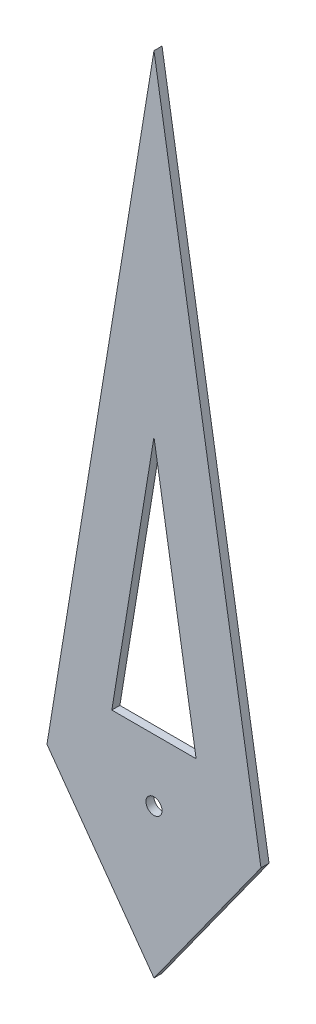
ISO-10303-21;
HEADER;
FILE_DESCRIPTION(('STEP AP214'),'2;1');
FILE_NAME('part.step','',(''),(''),'','','');
FILE_SCHEMA(('AUTOMOTIVE_DESIGN { 1 0 10303 214 1 1 1 1 }'));
ENDSEC;
DATA;
#1=APPLICATION_CONTEXT('core data for automotive mechanical design processes');
#2=APPLICATION_PROTOCOL_DEFINITION('international standard','automotive_design',2000,#1);
#3=PRODUCT_CONTEXT('',#1,'mechanical');
#4=PRODUCT('Part','Part','',(#3));
#5=PRODUCT_RELATED_PRODUCT_CATEGORY('part','',(#4));
#6=PRODUCT_DEFINITION_FORMATION('','',#4);
#7=PRODUCT_DEFINITION_CONTEXT('part definition',#1,'design');
#8=PRODUCT_DEFINITION('design','',#6,#7);
#9=PRODUCT_DEFINITION_SHAPE('','',#8);
#10=(LENGTH_UNIT() NAMED_UNIT(*) SI_UNIT(.MILLI.,.METRE.));
#11=(NAMED_UNIT(*) PLANE_ANGLE_UNIT() SI_UNIT($,.RADIAN.));
#12=(NAMED_UNIT(*) SI_UNIT($,.STERADIAN.) SOLID_ANGLE_UNIT());
#13=UNCERTAINTY_MEASURE_WITH_UNIT(LENGTH_MEASURE(1.E-05),#10,'distance_accuracy_value','');
#14=(GEOMETRIC_REPRESENTATION_CONTEXT(3) GLOBAL_UNCERTAINTY_ASSIGNED_CONTEXT((#13)) GLOBAL_UNIT_ASSIGNED_CONTEXT((#10,
#11,#12)) REPRESENTATION_CONTEXT('',''));
#15=CARTESIAN_POINT('',(0.,0.,0.));
#16=DIRECTION('',(0.,0.,1.));
#17=DIRECTION('',(1.,0.,0.));
#18=AXIS2_PLACEMENT_3D('',#15,#16,#17);
#19=CARTESIAN_POINT('',(-0.664568147771195,-0.385728496269406,0.05));
#20=DIRECTION('',(0.,0.,1.));
#21=DIRECTION('',(1.,0.,0.));
#22=AXIS2_PLACEMENT_3D('',#19,#20,#21);
#23=PLANE('',#22);
#24=CARTESIAN_POINT('',(0.,-0.385728496269408,0.05));
#25=DIRECTION('',(0.,0.,1.));
#26=DIRECTION('',(1.,0.,0.));
#27=AXIS2_PLACEMENT_3D('',#24,#25,#26);
#28=CIRCLE('',#27,0.05);
#29=CARTESIAN_POINT('',(0.05,-0.385728496269408,0.05));
#30=VERTEX_POINT('',#29);
#31=EDGE_CURVE('E206',#30,#30,#28,.T.);
#32=ORIENTED_EDGE('',*,*,#31,.F.);
#33=EDGE_LOOP('',(#32));
#34=FACE_BOUND('',#33,.T.);
#35=DIRECTION('',(-0.161416191453951,-0.986886423625587,0.));
#36=VECTOR('',#35,1.);
#37=CARTESIAN_POINT('',(0.,3.67739105017645,0.05));
#38=LINE('',#37,#36);
#39=CARTESIAN_POINT('',(0.,3.67739105017645,0.05));
#40=VERTEX_POINT('',#39);
#41=CARTESIAN_POINT('',(-0.664568147771194,-0.385728496269408,0.05));
#42=VERTEX_POINT('',#41);
#43=EDGE_CURVE('E121',#40,#42,#38,.T.);
#44=ORIENTED_EDGE('',*,*,#43,.T.);
#45=DIRECTION('',(0.58369559883618,-0.811972565977,0.));
#46=VECTOR('',#45,1.);
#47=CARTESIAN_POINT('',(-0.664568147771194,-0.385728496269408,0.05));
#48=LINE('',#47,#46);
#49=CARTESIAN_POINT('',(0.,-1.31020198088755,0.05));
#50=VERTEX_POINT('',#49);
#51=EDGE_CURVE('E124',#42,#50,#48,.T.);
#52=ORIENTED_EDGE('',*,*,#51,.T.);
#53=DIRECTION('',(0.58369559883618,0.811972565977,0.));
#54=VECTOR('',#53,1.);
#55=CARTESIAN_POINT('',(0.664568147771193,-0.385728496269408,0.05));
#56=LINE('',#55,#54);
#57=CARTESIAN_POINT('',(0.664568147771193,-0.385728496269408,0.05));
#58=VERTEX_POINT('',#57);
#59=EDGE_CURVE('E127',#50,#58,#56,.T.);
#60=ORIENTED_EDGE('',*,*,#59,.T.);
#61=DIRECTION('',(-0.16141619145395,0.986886423625587,0.));
#62=VECTOR('',#61,1.);
#63=CARTESIAN_POINT('',(0.,3.67739105017645,0.05));
#64=LINE('',#63,#62);
#65=EDGE_CURVE('E129',#58,#40,#64,.T.);
#66=ORIENTED_EDGE('',*,*,#65,.T.);
#67=EDGE_LOOP('',(#44,#52,#60,#66));
#68=FACE_BOUND('',#67,.T.);
#69=DIRECTION('',(-0.161416191453951,-0.986886423625587,0.));
#70=VECTOR('',#69,1.);
#71=CARTESIAN_POINT('',(-0.261710048707495,0.,0.05));
#72=LINE('',#71,#70);
#73=CARTESIAN_POINT('',(0.,1.60007550462805,0.05));
#74=VERTEX_POINT('',#73);
#75=CARTESIAN_POINT('',(-0.261710048707495,0.,0.05));
#76=VERTEX_POINT('',#75);
#77=EDGE_CURVE('E100',#74,#76,#72,.T.);
#78=ORIENTED_EDGE('',*,*,#77,.F.);
#79=DIRECTION('',(-0.161416191453952,0.986886423625587,0.));
#80=VECTOR('',#79,1.);
#81=CARTESIAN_POINT('',(0.261710048707498,0.,0.05));
#82=LINE('',#81,#80);
#83=CARTESIAN_POINT('',(0.261710048707498,0.,0.05));
#84=VERTEX_POINT('',#83);
#85=EDGE_CURVE('E92',#84,#74,#82,.T.);
#86=ORIENTED_EDGE('',*,*,#85,.F.);
#87=DIRECTION('',(1.,0.,0.));
#88=VECTOR('',#87,1.);
#89=CARTESIAN_POINT('',(-0.261710048707495,0.,0.05));
#90=LINE('',#89,#88);
#91=EDGE_CURVE('E109',#76,#84,#90,.T.);
#92=ORIENTED_EDGE('',*,*,#91,.F.);
#93=EDGE_LOOP('',(#78,#86,#92));
#94=FACE_BOUND('',#93,.T.);
#95=ADVANCED_FACE('F33',(#34,#68,#94),#23,.T.);
#96=CARTESIAN_POINT('',(-0.664568147771195,-0.385728496269406,0.));
#97=DIRECTION('',(0.,0.,1.));
#98=DIRECTION('',(1.,0.,0.));
#99=AXIS2_PLACEMENT_3D('',#96,#97,#98);
#100=PLANE('',#99);
#101=CARTESIAN_POINT('',(0.,-0.385728496269408,0.));
#102=DIRECTION('',(0.,0.,1.));
#103=DIRECTION('',(1.,0.,0.));
#104=AXIS2_PLACEMENT_3D('',#101,#102,#103);
#105=CIRCLE('',#104,0.05);
#106=CARTESIAN_POINT('',(0.05,-0.385728496269408,0.));
#107=VERTEX_POINT('',#106);
#108=EDGE_CURVE('E115',#107,#107,#105,.T.);
#109=ORIENTED_EDGE('',*,*,#108,.T.);
#110=EDGE_LOOP('',(#109));
#111=FACE_BOUND('',#110,.T.);
#112=DIRECTION('',(-0.161416191453951,-0.986886423625587,0.));
#113=VECTOR('',#112,1.);
#114=CARTESIAN_POINT('',(0.,3.67739105017645,0.));
#115=LINE('',#114,#113);
#116=CARTESIAN_POINT('',(0.,3.67739105017645,0.));
#117=VERTEX_POINT('',#116);
#118=CARTESIAN_POINT('',(-0.664568147771194,-0.385728496269408,0.));
#119=VERTEX_POINT('',#118);
#120=EDGE_CURVE('E107',#117,#119,#115,.T.);
#121=ORIENTED_EDGE('',*,*,#120,.F.);
#122=DIRECTION('',(-0.16141619145395,0.986886423625587,0.));
#123=VECTOR('',#122,1.);
#124=CARTESIAN_POINT('',(0.,3.67739105017645,0.));
#125=LINE('',#124,#123);
#126=CARTESIAN_POINT('',(0.664568147771193,-0.385728496269408,0.));
#127=VERTEX_POINT('',#126);
#128=EDGE_CURVE('E125',#127,#117,#125,.T.);
#129=ORIENTED_EDGE('',*,*,#128,.F.);
#130=DIRECTION('',(0.58369559883618,0.811972565977,0.));
#131=VECTOR('',#130,1.);
#132=CARTESIAN_POINT('',(0.664568147771193,-0.385728496269408,0.));
#133=LINE('',#132,#131);
#134=CARTESIAN_POINT('',(0.,-1.31020198088755,0.));
#135=VERTEX_POINT('',#134);
#136=EDGE_CURVE('E136',#135,#127,#133,.T.);
#137=ORIENTED_EDGE('',*,*,#136,.F.);
#138=DIRECTION('',(0.58369559883618,-0.811972565977,0.));
#139=VECTOR('',#138,1.);
#140=CARTESIAN_POINT('',(-0.664568147771194,-0.385728496269408,0.));
#141=LINE('',#140,#139);
#142=EDGE_CURVE('E134',#119,#135,#141,.T.);
#143=ORIENTED_EDGE('',*,*,#142,.F.);
#144=EDGE_LOOP('',(#121,#129,#137,#143));
#145=FACE_BOUND('',#144,.T.);
#146=DIRECTION('',(-0.161416191453952,0.986886423625587,0.));
#147=VECTOR('',#146,1.);
#148=CARTESIAN_POINT('',(0.261710048707498,0.,0.));
#149=LINE('',#148,#147);
#150=CARTESIAN_POINT('',(0.261710048707498,0.,0.));
#151=VERTEX_POINT('',#150);
#152=CARTESIAN_POINT('',(0.,1.60007550462805,0.));
#153=VERTEX_POINT('',#152);
#154=EDGE_CURVE('E56',#151,#153,#149,.T.);
#155=ORIENTED_EDGE('',*,*,#154,.T.);
#156=DIRECTION('',(-0.161416191453951,-0.986886423625587,0.));
#157=VECTOR('',#156,1.);
#158=CARTESIAN_POINT('',(-0.261710048707495,0.,0.));
#159=LINE('',#158,#157);
#160=CARTESIAN_POINT('',(-0.261710048707495,0.,0.));
#161=VERTEX_POINT('',#160);
#162=EDGE_CURVE('E106',#153,#161,#159,.T.);
#163=ORIENTED_EDGE('',*,*,#162,.T.);
#164=DIRECTION('',(1.,0.,0.));
#165=VECTOR('',#164,1.);
#166=CARTESIAN_POINT('',(-0.261710048707495,0.,0.));
#167=LINE('',#166,#165);
#168=EDGE_CURVE('E101',#161,#151,#167,.T.);
#169=ORIENTED_EDGE('',*,*,#168,.T.);
#170=EDGE_LOOP('',(#155,#163,#169));
#171=FACE_BOUND('',#170,.T.);
#172=ADVANCED_FACE('F154',(#111,#145,#171),#100,.F.);
#173=CARTESIAN_POINT('',(0.,3.67739105017645,0.05));
#174=DIRECTION('',(0.986886423625587,-0.161416191453951,0.));
#175=DIRECTION('',(0.161416191453951,0.986886423625587,0.));
#176=AXIS2_PLACEMENT_3D('',#173,#174,#175);
#177=PLANE('',#176);
#178=ORIENTED_EDGE('',*,*,#120,.T.);
#179=DIRECTION('',(0.,0.,-1.));
#180=VECTOR('',#179,1.);
#181=CARTESIAN_POINT('',(-0.664568147771194,-0.385728496269408,0.05));
#182=LINE('',#181,#180);
#183=EDGE_CURVE('E11',#42,#119,#182,.T.);
#184=ORIENTED_EDGE('',*,*,#183,.F.);
#185=ORIENTED_EDGE('',*,*,#43,.F.);
#186=DIRECTION('',(0.,0.,-1.));
#187=VECTOR('',#186,1.);
#188=CARTESIAN_POINT('',(0.,3.67739105017645,0.05));
#189=LINE('',#188,#187);
#190=EDGE_CURVE('E131',#40,#117,#189,.T.);
#191=ORIENTED_EDGE('',*,*,#190,.T.);
#192=EDGE_LOOP('',(#178,#184,#185,#191));
#193=FACE_BOUND('',#192,.T.);
#194=ADVANCED_FACE('F35',(#193),#177,.F.);
#195=CARTESIAN_POINT('',(-0.664568147771194,-0.385728496269408,0.05));
#196=DIRECTION('',(0.811972565977,0.58369559883618,0.));
#197=DIRECTION('',(-0.58369559883618,0.811972565977,0.));
#198=AXIS2_PLACEMENT_3D('',#195,#196,#197);
#199=PLANE('',#198);
#200=ORIENTED_EDGE('',*,*,#142,.T.);
#201=DIRECTION('',(0.,0.,-1.));
#202=VECTOR('',#201,1.);
#203=CARTESIAN_POINT('',(0.,-1.31020198088755,0.05));
#204=LINE('',#203,#202);
#205=EDGE_CURVE('E41',#50,#135,#204,.T.);
#206=ORIENTED_EDGE('',*,*,#205,.F.);
#207=ORIENTED_EDGE('',*,*,#51,.F.);
#208=ORIENTED_EDGE('',*,*,#183,.T.);
#209=EDGE_LOOP('',(#200,#206,#207,#208));
#210=FACE_BOUND('',#209,.T.);
#211=ADVANCED_FACE('F164',(#210),#199,.F.);
#212=CARTESIAN_POINT('',(0.664568147771193,-0.385728496269408,0.05));
#213=DIRECTION('',(-0.811972565977,0.58369559883618,0.));
#214=DIRECTION('',(-0.58369559883618,-0.811972565977,0.));
#215=AXIS2_PLACEMENT_3D('',#212,#213,#214);
#216=PLANE('',#215);
#217=ORIENTED_EDGE('',*,*,#136,.T.);
#218=DIRECTION('',(0.,0.,-1.));
#219=VECTOR('',#218,1.);
#220=CARTESIAN_POINT('',(0.664568147771193,-0.385728496269408,0.05));
#221=LINE('',#220,#219);
#222=EDGE_CURVE('E141',#58,#127,#221,.T.);
#223=ORIENTED_EDGE('',*,*,#222,.F.);
#224=ORIENTED_EDGE('',*,*,#59,.F.);
#225=ORIENTED_EDGE('',*,*,#205,.T.);
#226=EDGE_LOOP('',(#217,#223,#224,#225));
#227=FACE_BOUND('',#226,.T.);
#228=ADVANCED_FACE('F148',(#227),#216,.F.);
#229=CARTESIAN_POINT('',(0.,3.67739105017645,0.05));
#230=DIRECTION('',(-0.986886423625587,-0.16141619145395,0.));
#231=DIRECTION('',(0.16141619145395,-0.986886423625587,0.));
#232=AXIS2_PLACEMENT_3D('',#229,#230,#231);
#233=PLANE('',#232);
#234=ORIENTED_EDGE('',*,*,#128,.T.);
#235=ORIENTED_EDGE('',*,*,#190,.F.);
#236=ORIENTED_EDGE('',*,*,#65,.F.);
#237=ORIENTED_EDGE('',*,*,#222,.T.);
#238=EDGE_LOOP('',(#234,#235,#236,#237));
#239=FACE_BOUND('',#238,.T.);
#240=ADVANCED_FACE('F158',(#239),#233,.F.);
#241=CARTESIAN_POINT('',(0.261710048707498,0.,0.05));
#242=DIRECTION('',(-0.986886423625587,-0.161416191453952,0.));
#243=DIRECTION('',(0.161416191453952,-0.986886423625587,0.));
#244=AXIS2_PLACEMENT_3D('',#241,#242,#243);
#245=PLANE('',#244);
#246=ORIENTED_EDGE('',*,*,#154,.F.);
#247=DIRECTION('',(0.,0.,-1.));
#248=VECTOR('',#247,1.);
#249=CARTESIAN_POINT('',(0.261710048707498,0.,0.05));
#250=LINE('',#249,#248);
#251=EDGE_CURVE('E96',#84,#151,#250,.T.);
#252=ORIENTED_EDGE('',*,*,#251,.F.);
#253=ORIENTED_EDGE('',*,*,#85,.T.);
#254=DIRECTION('',(0.,0.,-1.));
#255=VECTOR('',#254,1.);
#256=CARTESIAN_POINT('',(0.,1.60007550462805,0.05));
#257=LINE('',#256,#255);
#258=EDGE_CURVE('E95',#74,#153,#257,.T.);
#259=ORIENTED_EDGE('',*,*,#258,.T.);
#260=EDGE_LOOP('',(#246,#252,#253,#259));
#261=FACE_BOUND('',#260,.T.);
#262=ADVANCED_FACE('F94',(#261),#245,.T.);
#263=CARTESIAN_POINT('',(-0.261710048707495,0.,0.05));
#264=DIRECTION('',(0.986886423625587,-0.161416191453951,0.));
#265=DIRECTION('',(0.161416191453951,0.986886423625587,0.));
#266=AXIS2_PLACEMENT_3D('',#263,#264,#265);
#267=PLANE('',#266);
#268=ORIENTED_EDGE('',*,*,#162,.F.);
#269=ORIENTED_EDGE('',*,*,#258,.F.);
#270=ORIENTED_EDGE('',*,*,#77,.T.);
#271=DIRECTION('',(0.,0.,-1.));
#272=VECTOR('',#271,1.);
#273=CARTESIAN_POINT('',(-0.261710048707495,0.,0.05));
#274=LINE('',#273,#272);
#275=EDGE_CURVE('E48',#76,#161,#274,.T.);
#276=ORIENTED_EDGE('',*,*,#275,.T.);
#277=EDGE_LOOP('',(#268,#269,#270,#276));
#278=FACE_BOUND('',#277,.T.);
#279=ADVANCED_FACE('F104',(#278),#267,.T.);
#280=CARTESIAN_POINT('',(-0.261710048707495,0.,0.05));
#281=DIRECTION('',(0.,1.,0.));
#282=DIRECTION('',(-1.,0.,0.));
#283=AXIS2_PLACEMENT_3D('',#280,#281,#282);
#284=PLANE('',#283);
#285=ORIENTED_EDGE('',*,*,#168,.F.);
#286=ORIENTED_EDGE('',*,*,#275,.F.);
#287=ORIENTED_EDGE('',*,*,#91,.T.);
#288=ORIENTED_EDGE('',*,*,#251,.T.);
#289=EDGE_LOOP('',(#285,#286,#287,#288));
#290=FACE_BOUND('',#289,.T.);
#291=ADVANCED_FACE('F191',(#290),#284,.T.);
#292=CARTESIAN_POINT('',(0.,-0.385728496269408,0.));
#293=DIRECTION('',(0.,0.,1.));
#294=DIRECTION('',(1.,0.,0.));
#295=AXIS2_PLACEMENT_3D('',#292,#293,#294);
#296=CYLINDRICAL_SURFACE('',#295,0.05);
#297=ORIENTED_EDGE('',*,*,#108,.F.);
#298=EDGE_LOOP('',(#297));
#299=FACE_BOUND('',#298,.T.);
#300=ORIENTED_EDGE('',*,*,#31,.T.);
#301=EDGE_LOOP('',(#300));
#302=FACE_BOUND('',#301,.T.);
#303=ADVANCED_FACE('F195',(#299,#302),#296,.F.);
#304=CLOSED_SHELL('',(#95,#172,#194,#211,#228,#240,#262,#279,#291,#303));
#305=MANIFOLD_SOLID_BREP('B2',#304);
#306=ADVANCED_BREP_SHAPE_REPRESENTATION('',(#18,#305),#14);
#307=SHAPE_DEFINITION_REPRESENTATION(#9,#306);
ENDSEC;
END-ISO-10303-21;
